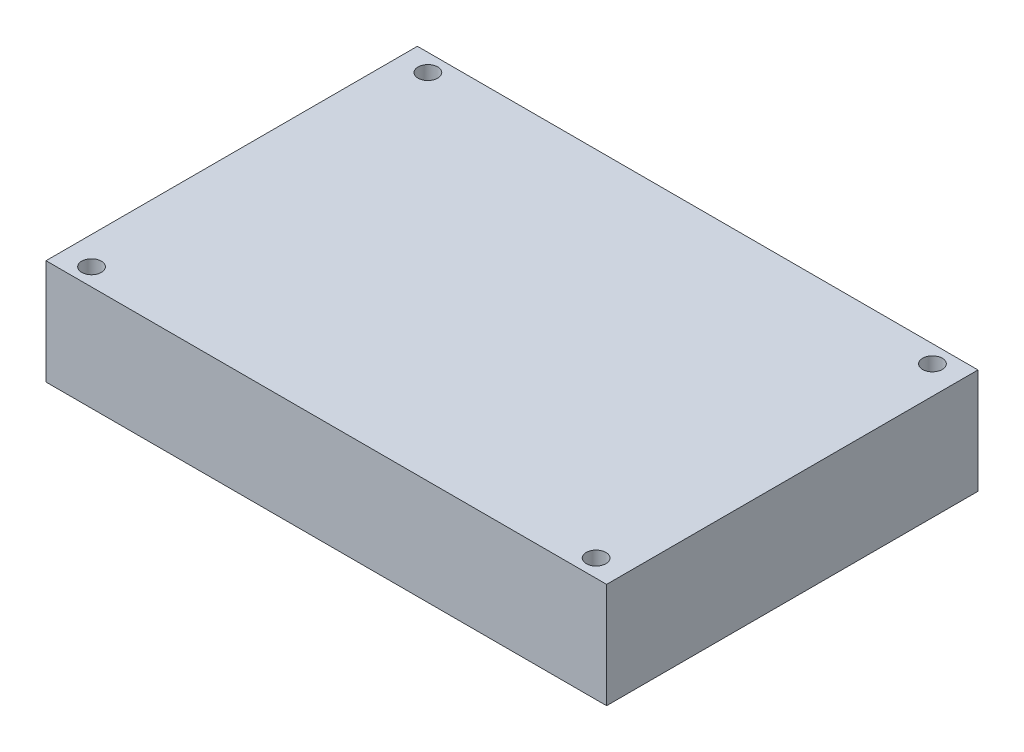
ISO-10303-21;
HEADER;
FILE_DESCRIPTION(('STEP AP214'),'2;1');
FILE_NAME('part.step','',(''),(''),'','','');
FILE_SCHEMA(('AUTOMOTIVE_DESIGN { 1 0 10303 214 1 1 1 1 }'));
ENDSEC;
DATA;
#1=APPLICATION_CONTEXT('core data for automotive mechanical design processes');
#2=APPLICATION_PROTOCOL_DEFINITION('international standard','automotive_design',2000,#1);
#3=PRODUCT_CONTEXT('',#1,'mechanical');
#4=PRODUCT('Part','Part','',(#3));
#5=PRODUCT_RELATED_PRODUCT_CATEGORY('part','',(#4));
#6=PRODUCT_DEFINITION_FORMATION('','',#4);
#7=PRODUCT_DEFINITION_CONTEXT('part definition',#1,'design');
#8=PRODUCT_DEFINITION('design','',#6,#7);
#9=PRODUCT_DEFINITION_SHAPE('','',#8);
#10=(LENGTH_UNIT() NAMED_UNIT(*) SI_UNIT(.MILLI.,.METRE.));
#11=(NAMED_UNIT(*) PLANE_ANGLE_UNIT() SI_UNIT($,.RADIAN.));
#12=(NAMED_UNIT(*) SI_UNIT($,.STERADIAN.) SOLID_ANGLE_UNIT());
#13=UNCERTAINTY_MEASURE_WITH_UNIT(LENGTH_MEASURE(1.E-05),#10,'distance_accuracy_value','');
#14=(GEOMETRIC_REPRESENTATION_CONTEXT(3) GLOBAL_UNCERTAINTY_ASSIGNED_CONTEXT((#13)) GLOBAL_UNIT_ASSIGNED_CONTEXT((#10,
#11,#12)) REPRESENTATION_CONTEXT('',''));
#15=CARTESIAN_POINT('',(0.,0.,0.));
#16=DIRECTION('',(0.,0.,1.));
#17=DIRECTION('',(1.,0.,0.));
#18=AXIS2_PLACEMENT_3D('',#15,#16,#17);
#19=CARTESIAN_POINT('',(0.,15.,0.));
#20=DIRECTION('',(0.,-1.,0.));
#21=DIRECTION('',(0.,0.,-1.));
#22=AXIS2_PLACEMENT_3D('',#19,#20,#21);
#23=PLANE('',#22);
#24=DIRECTION('',(-1.,0.,0.));
#25=VECTOR('',#24,1.);
#26=CARTESIAN_POINT('',(41.5000000000001,15.,-52.9999999999999));
#27=LINE('',#26,#25);
#28=CARTESIAN_POINT('',(80.0000000000001,15.,-52.9999999999999));
#29=VERTEX_POINT('',#28);
#30=CARTESIAN_POINT('',(0.,15.,-52.9999999999999));
#31=VERTEX_POINT('',#30);
#32=EDGE_CURVE('E83',#29,#31,#27,.T.);
#33=ORIENTED_EDGE('',*,*,#32,.T.);
#34=DIRECTION('',(0.,0.,1.));
#35=VECTOR('',#34,1.);
#36=CARTESIAN_POINT('',(0.,15.,0.));
#37=LINE('',#36,#35);
#38=CARTESIAN_POINT('',(0.,15.,0.));
#39=VERTEX_POINT('',#38);
#40=EDGE_CURVE('E86',#31,#39,#37,.T.);
#41=ORIENTED_EDGE('',*,*,#40,.T.);
#42=DIRECTION('',(1.,0.,0.));
#43=VECTOR('',#42,1.);
#44=CARTESIAN_POINT('',(0.,15.,0.));
#45=LINE('',#44,#43);
#46=CARTESIAN_POINT('',(80.0000000000001,15.,0.));
#47=VERTEX_POINT('',#46);
#48=EDGE_CURVE('E90',#39,#47,#45,.T.);
#49=ORIENTED_EDGE('',*,*,#48,.T.);
#50=DIRECTION('',(0.,0.,-1.));
#51=VECTOR('',#50,1.);
#52=CARTESIAN_POINT('',(80.0000000000001,15.,-52.9999999999999));
#53=LINE('',#52,#51);
#54=EDGE_CURVE('E54',#47,#29,#53,.T.);
#55=ORIENTED_EDGE('',*,*,#54,.T.);
#56=EDGE_LOOP('',(#33,#41,#49,#55));
#57=FACE_BOUND('',#56,.T.);
#58=CARTESIAN_POINT('',(76.0000000000001,15.,-50.5));
#59=DIRECTION('',(0.,1.,0.));
#60=DIRECTION('',(0.,0.,1.));
#61=AXIS2_PLACEMENT_3D('',#58,#59,#60);
#62=CIRCLE('',#61,1.39999999999985);
#63=CARTESIAN_POINT('',(76.0000000000001,15.,-49.1000000000001));
#64=VERTEX_POINT('',#63);
#65=EDGE_CURVE('E103',#64,#64,#62,.T.);
#66=ORIENTED_EDGE('',*,*,#65,.F.);
#67=EDGE_LOOP('',(#66));
#68=FACE_BOUND('',#67,.T.);
#69=CARTESIAN_POINT('',(76.0000000000001,15.,-2.49999999999995));
#70=DIRECTION('',(0.,1.,0.));
#71=DIRECTION('',(0.,0.,1.));
#72=AXIS2_PLACEMENT_3D('',#69,#70,#71);
#73=CIRCLE('',#72,1.39999999999985);
#74=CARTESIAN_POINT('',(76.0000000000001,15.,-1.1000000000001));
#75=VERTEX_POINT('',#74);
#76=EDGE_CURVE('E136',#75,#75,#73,.T.);
#77=ORIENTED_EDGE('',*,*,#76,.F.);
#78=EDGE_LOOP('',(#77));
#79=FACE_BOUND('',#78,.T.);
#80=CARTESIAN_POINT('',(4.,15.,-50.5));
#81=DIRECTION('',(0.,1.,0.));
#82=DIRECTION('',(0.,0.,1.));
#83=AXIS2_PLACEMENT_3D('',#80,#81,#82);
#84=CIRCLE('',#83,1.39999999999996);
#85=CARTESIAN_POINT('',(4.,15.,-49.1));
#86=VERTEX_POINT('',#85);
#87=EDGE_CURVE('E131',#86,#86,#84,.T.);
#88=ORIENTED_EDGE('',*,*,#87,.F.);
#89=EDGE_LOOP('',(#88));
#90=FACE_BOUND('',#89,.T.);
#91=CARTESIAN_POINT('',(4.,15.,-2.49999999999995));
#92=DIRECTION('',(0.,1.,0.));
#93=DIRECTION('',(0.,0.,1.));
#94=AXIS2_PLACEMENT_3D('',#91,#92,#93);
#95=CIRCLE('',#94,1.39999999999996);
#96=CARTESIAN_POINT('',(4.,15.,-1.09999999999999));
#97=VERTEX_POINT('',#96);
#98=EDGE_CURVE('E125',#97,#97,#95,.T.);
#99=ORIENTED_EDGE('',*,*,#98,.F.);
#100=EDGE_LOOP('',(#99));
#101=FACE_BOUND('',#100,.T.);
#102=ADVANCED_FACE('F37',(#57,#68,#79,#90,#101),#23,.F.);
#103=CARTESIAN_POINT('',(0.,0.,0.));
#104=DIRECTION('',(0.,-1.,0.));
#105=DIRECTION('',(0.,0.,-1.));
#106=AXIS2_PLACEMENT_3D('',#103,#104,#105);
#107=PLANE('',#106);
#108=CARTESIAN_POINT('',(4.,0.,-50.5));
#109=DIRECTION('',(0.,1.,0.));
#110=DIRECTION('',(0.,0.,1.));
#111=AXIS2_PLACEMENT_3D('',#108,#109,#110);
#112=CIRCLE('',#111,1.39999999999996);
#113=CARTESIAN_POINT('',(4.,0.,-49.1));
#114=VERTEX_POINT('',#113);
#115=EDGE_CURVE('E128',#114,#114,#112,.T.);
#116=ORIENTED_EDGE('',*,*,#115,.T.);
#117=EDGE_LOOP('',(#116));
#118=FACE_BOUND('',#117,.T.);
#119=CARTESIAN_POINT('',(76.0000000000001,0.,-50.5));
#120=DIRECTION('',(0.,1.,0.));
#121=DIRECTION('',(0.,0.,1.));
#122=AXIS2_PLACEMENT_3D('',#119,#120,#121);
#123=CIRCLE('',#122,1.39999999999985);
#124=CARTESIAN_POINT('',(76.0000000000001,0.,-49.1000000000001));
#125=VERTEX_POINT('',#124);
#126=EDGE_CURVE('E139',#125,#125,#123,.T.);
#127=ORIENTED_EDGE('',*,*,#126,.T.);
#128=EDGE_LOOP('',(#127));
#129=FACE_BOUND('',#128,.T.);
#130=DIRECTION('',(-1.,0.,0.));
#131=VECTOR('',#130,1.);
#132=CARTESIAN_POINT('',(0.,0.,-52.9999999999999));
#133=LINE('',#132,#131);
#134=CARTESIAN_POINT('',(80.0000000000001,0.,-52.9999999999999));
#135=VERTEX_POINT('',#134);
#136=CARTESIAN_POINT('',(0.,0.,-52.9999999999999));
#137=VERTEX_POINT('',#136);
#138=EDGE_CURVE('E78',#135,#137,#133,.T.);
#139=ORIENTED_EDGE('',*,*,#138,.F.);
#140=DIRECTION('',(0.,0.,-1.));
#141=VECTOR('',#140,1.);
#142=CARTESIAN_POINT('',(80.0000000000001,0.,-52.9999999999999));
#143=LINE('',#142,#141);
#144=CARTESIAN_POINT('',(80.0000000000001,0.,0.));
#145=VERTEX_POINT('',#144);
#146=EDGE_CURVE('E106',#145,#135,#143,.T.);
#147=ORIENTED_EDGE('',*,*,#146,.F.);
#148=DIRECTION('',(1.,0.,0.));
#149=VECTOR('',#148,1.);
#150=CARTESIAN_POINT('',(0.,0.,0.));
#151=LINE('',#150,#149);
#152=CARTESIAN_POINT('',(0.,0.,0.));
#153=VERTEX_POINT('',#152);
#154=EDGE_CURVE('E71',#153,#145,#151,.T.);
#155=ORIENTED_EDGE('',*,*,#154,.F.);
#156=DIRECTION('',(0.,0.,1.));
#157=VECTOR('',#156,1.);
#158=CARTESIAN_POINT('',(0.,0.,0.));
#159=LINE('',#158,#157);
#160=EDGE_CURVE('E94',#137,#153,#159,.T.);
#161=ORIENTED_EDGE('',*,*,#160,.F.);
#162=EDGE_LOOP('',(#139,#147,#155,#161));
#163=FACE_BOUND('',#162,.T.);
#164=CARTESIAN_POINT('',(76.0000000000001,0.,-2.49999999999995));
#165=DIRECTION('',(0.,1.,0.));
#166=DIRECTION('',(0.,0.,1.));
#167=AXIS2_PLACEMENT_3D('',#164,#165,#166);
#168=CIRCLE('',#167,1.39999999999985);
#169=CARTESIAN_POINT('',(76.0000000000001,0.,-1.1000000000001));
#170=VERTEX_POINT('',#169);
#171=EDGE_CURVE('E120',#170,#170,#168,.T.);
#172=ORIENTED_EDGE('',*,*,#171,.T.);
#173=EDGE_LOOP('',(#172));
#174=FACE_BOUND('',#173,.T.);
#175=CARTESIAN_POINT('',(4.,0.,-2.49999999999995));
#176=DIRECTION('',(0.,1.,0.));
#177=DIRECTION('',(0.,0.,1.));
#178=AXIS2_PLACEMENT_3D('',#175,#176,#177);
#179=CIRCLE('',#178,1.39999999999996);
#180=CARTESIAN_POINT('',(4.,0.,-1.09999999999999));
#181=VERTEX_POINT('',#180);
#182=EDGE_CURVE('E123',#181,#181,#179,.T.);
#183=ORIENTED_EDGE('',*,*,#182,.T.);
#184=EDGE_LOOP('',(#183));
#185=FACE_BOUND('',#184,.T.);
#186=ADVANCED_FACE('F112',(#118,#129,#163,#174,#185),#107,.T.);
#187=CARTESIAN_POINT('',(0.,15.,-52.9999999999999));
#188=DIRECTION('',(0.,0.,1.));
#189=DIRECTION('',(1.,0.,0.));
#190=AXIS2_PLACEMENT_3D('',#187,#188,#189);
#191=PLANE('',#190);
#192=ORIENTED_EDGE('',*,*,#138,.T.);
#193=DIRECTION('',(0.,-1.,0.));
#194=VECTOR('',#193,1.);
#195=CARTESIAN_POINT('',(0.,15.,-52.9999999999999));
#196=LINE('',#195,#194);
#197=EDGE_CURVE('E11',#31,#137,#196,.T.);
#198=ORIENTED_EDGE('',*,*,#197,.F.);
#199=ORIENTED_EDGE('',*,*,#32,.F.);
#200=DIRECTION('',(0.,-1.,0.));
#201=VECTOR('',#200,1.);
#202=CARTESIAN_POINT('',(80.0000000000001,15.,-52.9999999999999));
#203=LINE('',#202,#201);
#204=EDGE_CURVE('E98',#29,#135,#203,.T.);
#205=ORIENTED_EDGE('',*,*,#204,.T.);
#206=EDGE_LOOP('',(#192,#198,#199,#205));
#207=FACE_BOUND('',#206,.T.);
#208=ADVANCED_FACE('F39',(#207),#191,.F.);
#209=CARTESIAN_POINT('',(0.,15.,0.));
#210=DIRECTION('',(1.,0.,0.));
#211=DIRECTION('',(0.,0.,-1.));
#212=AXIS2_PLACEMENT_3D('',#209,#210,#211);
#213=PLANE('',#212);
#214=ORIENTED_EDGE('',*,*,#160,.T.);
#215=DIRECTION('',(0.,-1.,0.));
#216=VECTOR('',#215,1.);
#217=CARTESIAN_POINT('',(0.,15.,0.));
#218=LINE('',#217,#216);
#219=EDGE_CURVE('E46',#39,#153,#218,.T.);
#220=ORIENTED_EDGE('',*,*,#219,.F.);
#221=ORIENTED_EDGE('',*,*,#40,.F.);
#222=ORIENTED_EDGE('',*,*,#197,.T.);
#223=EDGE_LOOP('',(#214,#220,#221,#222));
#224=FACE_BOUND('',#223,.T.);
#225=ADVANCED_FACE('F93',(#224),#213,.F.);
#226=CARTESIAN_POINT('',(0.,15.,0.));
#227=DIRECTION('',(0.,0.,-1.));
#228=DIRECTION('',(-1.,0.,0.));
#229=AXIS2_PLACEMENT_3D('',#226,#227,#228);
#230=PLANE('',#229);
#231=ORIENTED_EDGE('',*,*,#154,.T.);
#232=DIRECTION('',(0.,-1.,0.));
#233=VECTOR('',#232,1.);
#234=CARTESIAN_POINT('',(80.0000000000001,15.,0.));
#235=LINE('',#234,#233);
#236=EDGE_CURVE('E95',#47,#145,#235,.T.);
#237=ORIENTED_EDGE('',*,*,#236,.F.);
#238=ORIENTED_EDGE('',*,*,#48,.F.);
#239=ORIENTED_EDGE('',*,*,#219,.T.);
#240=EDGE_LOOP('',(#231,#237,#238,#239));
#241=FACE_BOUND('',#240,.T.);
#242=ADVANCED_FACE('F96',(#241),#230,.F.);
#243=CARTESIAN_POINT('',(80.0000000000001,15.,-52.9999999999999));
#244=DIRECTION('',(-1.,0.,0.));
#245=DIRECTION('',(0.,0.,1.));
#246=AXIS2_PLACEMENT_3D('',#243,#244,#245);
#247=PLANE('',#246);
#248=ORIENTED_EDGE('',*,*,#146,.T.);
#249=ORIENTED_EDGE('',*,*,#204,.F.);
#250=ORIENTED_EDGE('',*,*,#54,.F.);
#251=ORIENTED_EDGE('',*,*,#236,.T.);
#252=EDGE_LOOP('',(#248,#249,#250,#251));
#253=FACE_BOUND('',#252,.T.);
#254=ADVANCED_FACE('F111',(#253),#247,.F.);
#255=CARTESIAN_POINT('',(76.0000000000001,15.,-50.5));
#256=DIRECTION('',(0.,-1.,0.));
#257=DIRECTION('',(0.,0.,-1.));
#258=AXIS2_PLACEMENT_3D('',#255,#256,#257);
#259=CYLINDRICAL_SURFACE('',#258,1.39999999999985);
#260=ORIENTED_EDGE('',*,*,#65,.T.);
#261=EDGE_LOOP('',(#260));
#262=FACE_BOUND('',#261,.T.);
#263=ORIENTED_EDGE('',*,*,#126,.F.);
#264=EDGE_LOOP('',(#263));
#265=FACE_BOUND('',#264,.T.);
#266=ADVANCED_FACE('F147',(#262,#265),#259,.F.);
#267=CARTESIAN_POINT('',(76.0000000000001,15.,-2.49999999999995));
#268=DIRECTION('',(0.,-1.,0.));
#269=DIRECTION('',(0.,0.,-1.));
#270=AXIS2_PLACEMENT_3D('',#267,#268,#269);
#271=CYLINDRICAL_SURFACE('',#270,1.39999999999985);
#272=ORIENTED_EDGE('',*,*,#76,.T.);
#273=EDGE_LOOP('',(#272));
#274=FACE_BOUND('',#273,.T.);
#275=ORIENTED_EDGE('',*,*,#171,.F.);
#276=EDGE_LOOP('',(#275));
#277=FACE_BOUND('',#276,.T.);
#278=ADVANCED_FACE('F149',(#274,#277),#271,.F.);
#279=CARTESIAN_POINT('',(4.,15.,-50.5));
#280=DIRECTION('',(0.,-1.,0.));
#281=DIRECTION('',(0.,0.,-1.));
#282=AXIS2_PLACEMENT_3D('',#279,#280,#281);
#283=CYLINDRICAL_SURFACE('',#282,1.39999999999996);
#284=ORIENTED_EDGE('',*,*,#87,.T.);
#285=EDGE_LOOP('',(#284));
#286=FACE_BOUND('',#285,.T.);
#287=ORIENTED_EDGE('',*,*,#115,.F.);
#288=EDGE_LOOP('',(#287));
#289=FACE_BOUND('',#288,.T.);
#290=ADVANCED_FACE('F156',(#286,#289),#283,.F.);
#291=CARTESIAN_POINT('',(4.,15.,-2.49999999999995));
#292=DIRECTION('',(0.,-1.,0.));
#293=DIRECTION('',(0.,0.,-1.));
#294=AXIS2_PLACEMENT_3D('',#291,#292,#293);
#295=CYLINDRICAL_SURFACE('',#294,1.39999999999996);
#296=ORIENTED_EDGE('',*,*,#98,.T.);
#297=EDGE_LOOP('',(#296));
#298=FACE_BOUND('',#297,.T.);
#299=ORIENTED_EDGE('',*,*,#182,.F.);
#300=EDGE_LOOP('',(#299));
#301=FACE_BOUND('',#300,.T.);
#302=ADVANCED_FACE('F222',(#298,#301),#295,.F.);
#303=CLOSED_SHELL('',(#102,#186,#208,#225,#242,#254,#266,#278,#290,#302));
#304=MANIFOLD_SOLID_BREP('B2',#303);
#305=ADVANCED_BREP_SHAPE_REPRESENTATION('',(#18,#304),#14);
#306=SHAPE_DEFINITION_REPRESENTATION(#9,#305);
ENDSEC;
END-ISO-10303-21;
